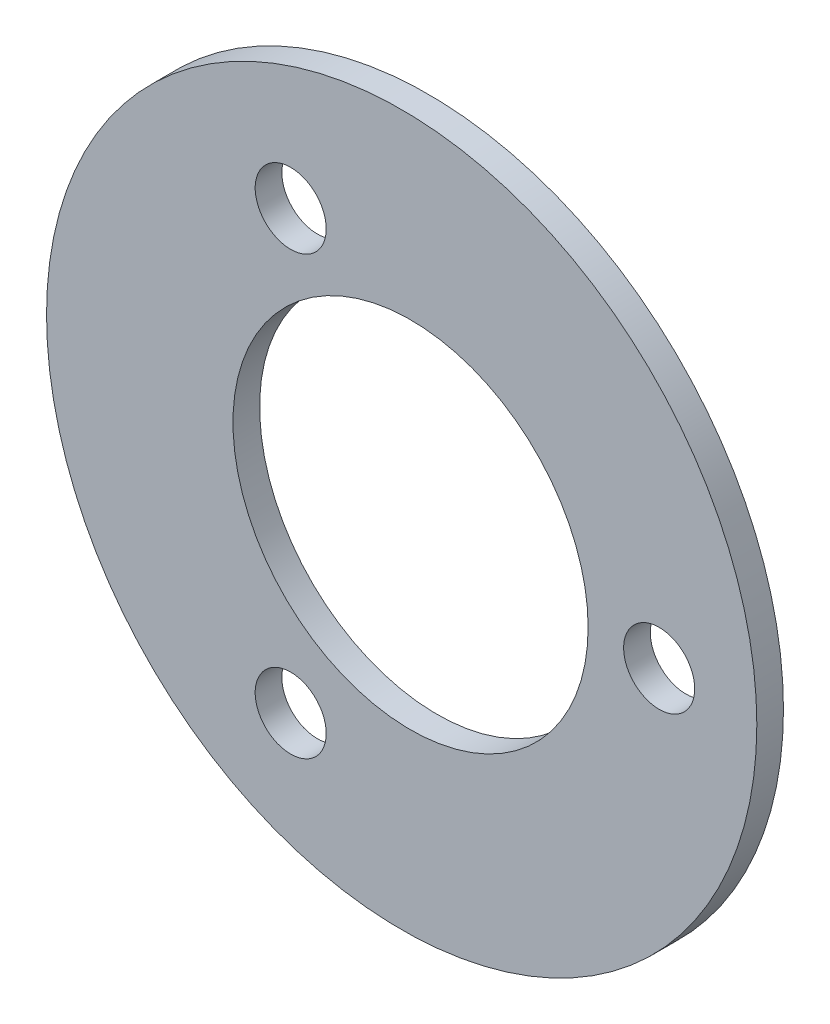
ISO-10303-21;
HEADER;
FILE_DESCRIPTION(('STEP AP214'),'2;1');
FILE_NAME('part.step','',(''),(''),'','','');
FILE_SCHEMA(('AUTOMOTIVE_DESIGN { 1 0 10303 214 1 1 1 1 }'));
ENDSEC;
DATA;
#1=APPLICATION_CONTEXT('core data for automotive mechanical design processes');
#2=APPLICATION_PROTOCOL_DEFINITION('international standard','automotive_design',2000,#1);
#3=PRODUCT_CONTEXT('',#1,'mechanical');
#4=PRODUCT('Part','Part','',(#3));
#5=PRODUCT_RELATED_PRODUCT_CATEGORY('part','',(#4));
#6=PRODUCT_DEFINITION_FORMATION('','',#4);
#7=PRODUCT_DEFINITION_CONTEXT('part definition',#1,'design');
#8=PRODUCT_DEFINITION('design','',#6,#7);
#9=PRODUCT_DEFINITION_SHAPE('','',#8);
#10=(LENGTH_UNIT() NAMED_UNIT(*) SI_UNIT(.MILLI.,.METRE.));
#11=(NAMED_UNIT(*) PLANE_ANGLE_UNIT() SI_UNIT($,.RADIAN.));
#12=(NAMED_UNIT(*) SI_UNIT($,.STERADIAN.) SOLID_ANGLE_UNIT());
#13=UNCERTAINTY_MEASURE_WITH_UNIT(LENGTH_MEASURE(1.E-05),#10,'distance_accuracy_value','');
#14=(GEOMETRIC_REPRESENTATION_CONTEXT(3) GLOBAL_UNCERTAINTY_ASSIGNED_CONTEXT((#13)) GLOBAL_UNIT_ASSIGNED_CONTEXT((#10,
#11,#12)) REPRESENTATION_CONTEXT('',''));
#15=CARTESIAN_POINT('',(0.,0.,0.));
#16=DIRECTION('',(0.,0.,1.));
#17=DIRECTION('',(1.,0.,0.));
#18=AXIS2_PLACEMENT_3D('',#15,#16,#17);
#19=CARTESIAN_POINT('',(-1.,0.,3.));
#20=DIRECTION('',(0.,0.,1.));
#21=DIRECTION('',(1.,0.,0.));
#22=AXIS2_PLACEMENT_3D('',#19,#20,#21);
#23=PLANE('',#22);
#24=CARTESIAN_POINT('',(-13.5,-25.1147367097486,3.));
#25=DIRECTION('',(0.,0.,1.));
#26=DIRECTION('',(1.,0.,0.));
#27=AXIS2_PLACEMENT_3D('',#24,#25,#26);
#28=CIRCLE('',#27,4.);
#29=CARTESIAN_POINT('',(-9.49999999999999,-25.1147367097486,3.));
#30=VERTEX_POINT('',#29);
#31=EDGE_CURVE('E59',#30,#30,#28,.T.);
#32=ORIENTED_EDGE('',*,*,#31,.F.);
#33=EDGE_LOOP('',(#32));
#34=FACE_BOUND('',#33,.T.);
#35=CARTESIAN_POINT('',(0.,0.,3.));
#36=DIRECTION('',(0.,0.,1.));
#37=DIRECTION('',(1.,0.,0.));
#38=AXIS2_PLACEMENT_3D('',#35,#36,#37);
#39=CIRCLE('',#38,20.);
#40=CARTESIAN_POINT('',(20.,0.,3.));
#41=VERTEX_POINT('',#40);
#42=EDGE_CURVE('E48',#41,#41,#39,.T.);
#43=ORIENTED_EDGE('',*,*,#42,.F.);
#44=EDGE_LOOP('',(#43));
#45=FACE_BOUND('',#44,.T.);
#46=CARTESIAN_POINT('',(-1.,0.,3.));
#47=DIRECTION('',(0.,0.,1.));
#48=DIRECTION('',(1.,0.,0.));
#49=AXIS2_PLACEMENT_3D('',#46,#47,#48);
#50=CIRCLE('',#49,40.);
#51=CARTESIAN_POINT('',(39.,0.,3.));
#52=VERTEX_POINT('',#51);
#53=EDGE_CURVE('E10',#52,#52,#50,.T.);
#54=ORIENTED_EDGE('',*,*,#53,.T.);
#55=EDGE_LOOP('',(#54));
#56=FACE_BOUND('',#55,.T.);
#57=CARTESIAN_POINT('',(28.,0.,3.));
#58=DIRECTION('',(0.,0.,1.));
#59=DIRECTION('',(1.,0.,0.));
#60=AXIS2_PLACEMENT_3D('',#57,#58,#59);
#61=CIRCLE('',#60,4.);
#62=CARTESIAN_POINT('',(32.,0.,3.));
#63=VERTEX_POINT('',#62);
#64=EDGE_CURVE('E53',#63,#63,#61,.T.);
#65=ORIENTED_EDGE('',*,*,#64,.F.);
#66=EDGE_LOOP('',(#65));
#67=FACE_BOUND('',#66,.T.);
#68=CARTESIAN_POINT('',(-13.4999999999997,24.1147367102514,3.));
#69=DIRECTION('',(0.,0.,1.));
#70=DIRECTION('',(1.,0.,0.));
#71=AXIS2_PLACEMENT_3D('',#68,#69,#70);
#72=CIRCLE('',#71,4.);
#73=CARTESIAN_POINT('',(-9.49999999999965,24.1147367102514,3.));
#74=VERTEX_POINT('',#73);
#75=EDGE_CURVE('E65',#74,#74,#72,.T.);
#76=ORIENTED_EDGE('',*,*,#75,.F.);
#77=EDGE_LOOP('',(#76));
#78=FACE_BOUND('',#77,.T.);
#79=ADVANCED_FACE('F37',(#34,#45,#56,#67,#78),#23,.T.);
#80=CARTESIAN_POINT('',(-1.,0.,0.));
#81=DIRECTION('',(0.,0.,1.));
#82=DIRECTION('',(1.,0.,0.));
#83=AXIS2_PLACEMENT_3D('',#80,#81,#82);
#84=PLANE('',#83);
#85=CARTESIAN_POINT('',(-1.,0.,0.));
#86=DIRECTION('',(0.,0.,1.));
#87=DIRECTION('',(1.,0.,0.));
#88=AXIS2_PLACEMENT_3D('',#85,#86,#87);
#89=CIRCLE('',#88,40.);
#90=CARTESIAN_POINT('',(39.,0.,0.));
#91=VERTEX_POINT('',#90);
#92=EDGE_CURVE('E41',#91,#91,#89,.T.);
#93=ORIENTED_EDGE('',*,*,#92,.F.);
#94=EDGE_LOOP('',(#93));
#95=FACE_BOUND('',#94,.T.);
#96=CARTESIAN_POINT('',(0.,0.,0.));
#97=DIRECTION('',(0.,0.,1.));
#98=DIRECTION('',(1.,0.,0.));
#99=AXIS2_PLACEMENT_3D('',#96,#97,#98);
#100=CIRCLE('',#99,20.);
#101=CARTESIAN_POINT('',(20.,0.,0.));
#102=VERTEX_POINT('',#101);
#103=EDGE_CURVE('E50',#102,#102,#100,.T.);
#104=ORIENTED_EDGE('',*,*,#103,.T.);
#105=EDGE_LOOP('',(#104));
#106=FACE_BOUND('',#105,.T.);
#107=CARTESIAN_POINT('',(28.,0.,0.));
#108=DIRECTION('',(0.,0.,1.));
#109=DIRECTION('',(1.,0.,0.));
#110=AXIS2_PLACEMENT_3D('',#107,#108,#109);
#111=CIRCLE('',#110,4.);
#112=CARTESIAN_POINT('',(32.,0.,0.));
#113=VERTEX_POINT('',#112);
#114=EDGE_CURVE('E56',#113,#113,#111,.T.);
#115=ORIENTED_EDGE('',*,*,#114,.T.);
#116=EDGE_LOOP('',(#115));
#117=FACE_BOUND('',#116,.T.);
#118=CARTESIAN_POINT('',(-13.5,-25.1147367097486,0.));
#119=DIRECTION('',(0.,0.,1.));
#120=DIRECTION('',(1.,0.,0.));
#121=AXIS2_PLACEMENT_3D('',#118,#119,#120);
#122=CIRCLE('',#121,4.);
#123=CARTESIAN_POINT('',(-9.49999999999999,-25.1147367097486,0.));
#124=VERTEX_POINT('',#123);
#125=EDGE_CURVE('E62',#124,#124,#122,.T.);
#126=ORIENTED_EDGE('',*,*,#125,.T.);
#127=EDGE_LOOP('',(#126));
#128=FACE_BOUND('',#127,.T.);
#129=CARTESIAN_POINT('',(-13.4999999999997,24.1147367102514,0.));
#130=DIRECTION('',(0.,0.,1.));
#131=DIRECTION('',(1.,0.,0.));
#132=AXIS2_PLACEMENT_3D('',#129,#130,#131);
#133=CIRCLE('',#132,4.);
#134=CARTESIAN_POINT('',(-9.49999999999965,24.1147367102514,0.));
#135=VERTEX_POINT('',#134);
#136=EDGE_CURVE('E68',#135,#135,#133,.T.);
#137=ORIENTED_EDGE('',*,*,#136,.T.);
#138=EDGE_LOOP('',(#137));
#139=FACE_BOUND('',#138,.T.);
#140=ADVANCED_FACE('F78',(#95,#106,#117,#128,#139),#84,.F.);
#141=CARTESIAN_POINT('',(-1.,0.,3.));
#142=DIRECTION('',(0.,0.,-1.));
#143=DIRECTION('',(-1.,0.,0.));
#144=AXIS2_PLACEMENT_3D('',#141,#142,#143);
#145=CYLINDRICAL_SURFACE('',#144,40.);
#146=ORIENTED_EDGE('',*,*,#53,.F.);
#147=EDGE_LOOP('',(#146));
#148=FACE_BOUND('',#147,.T.);
#149=ORIENTED_EDGE('',*,*,#92,.T.);
#150=EDGE_LOOP('',(#149));
#151=FACE_BOUND('',#150,.T.);
#152=ADVANCED_FACE('F39',(#148,#151),#145,.T.);
#153=CARTESIAN_POINT('',(0.,0.,3.));
#154=DIRECTION('',(0.,0.,-1.));
#155=DIRECTION('',(-1.,0.,0.));
#156=AXIS2_PLACEMENT_3D('',#153,#154,#155);
#157=CYLINDRICAL_SURFACE('',#156,20.);
#158=ORIENTED_EDGE('',*,*,#42,.T.);
#159=EDGE_LOOP('',(#158));
#160=FACE_BOUND('',#159,.T.);
#161=ORIENTED_EDGE('',*,*,#103,.F.);
#162=EDGE_LOOP('',(#161));
#163=FACE_BOUND('',#162,.T.);
#164=ADVANCED_FACE('F88',(#160,#163),#157,.F.);
#165=CARTESIAN_POINT('',(28.,0.,3.));
#166=DIRECTION('',(0.,0.,-1.));
#167=DIRECTION('',(-1.,0.,0.));
#168=AXIS2_PLACEMENT_3D('',#165,#166,#167);
#169=CYLINDRICAL_SURFACE('',#168,4.);
#170=ORIENTED_EDGE('',*,*,#64,.T.);
#171=EDGE_LOOP('',(#170));
#172=FACE_BOUND('',#171,.T.);
#173=ORIENTED_EDGE('',*,*,#114,.F.);
#174=EDGE_LOOP('',(#173));
#175=FACE_BOUND('',#174,.T.);
#176=ADVANCED_FACE('F91',(#172,#175),#169,.F.);
#177=CARTESIAN_POINT('',(-13.5,-25.1147367097486,3.));
#178=DIRECTION('',(0.,0.,-1.));
#179=DIRECTION('',(-1.,0.,0.));
#180=AXIS2_PLACEMENT_3D('',#177,#178,#179);
#181=CYLINDRICAL_SURFACE('',#180,4.);
#182=ORIENTED_EDGE('',*,*,#31,.T.);
#183=EDGE_LOOP('',(#182));
#184=FACE_BOUND('',#183,.T.);
#185=ORIENTED_EDGE('',*,*,#125,.F.);
#186=EDGE_LOOP('',(#185));
#187=FACE_BOUND('',#186,.T.);
#188=ADVANCED_FACE('F95',(#184,#187),#181,.F.);
#189=CARTESIAN_POINT('',(-13.4999999999997,24.1147367102514,3.));
#190=DIRECTION('',(0.,0.,-1.));
#191=DIRECTION('',(-1.,0.,0.));
#192=AXIS2_PLACEMENT_3D('',#189,#190,#191);
#193=CYLINDRICAL_SURFACE('',#192,4.);
#194=ORIENTED_EDGE('',*,*,#75,.T.);
#195=EDGE_LOOP('',(#194));
#196=FACE_BOUND('',#195,.T.);
#197=ORIENTED_EDGE('',*,*,#136,.F.);
#198=EDGE_LOOP('',(#197));
#199=FACE_BOUND('',#198,.T.);
#200=ADVANCED_FACE('F74',(#196,#199),#193,.F.);
#201=CLOSED_SHELL('',(#79,#140,#152,#164,#176,#188,#200));
#202=MANIFOLD_SOLID_BREP('B2',#201);
#203=ADVANCED_BREP_SHAPE_REPRESENTATION('',(#18,#202),#14);
#204=SHAPE_DEFINITION_REPRESENTATION(#9,#203);
ENDSEC;
END-ISO-10303-21;
